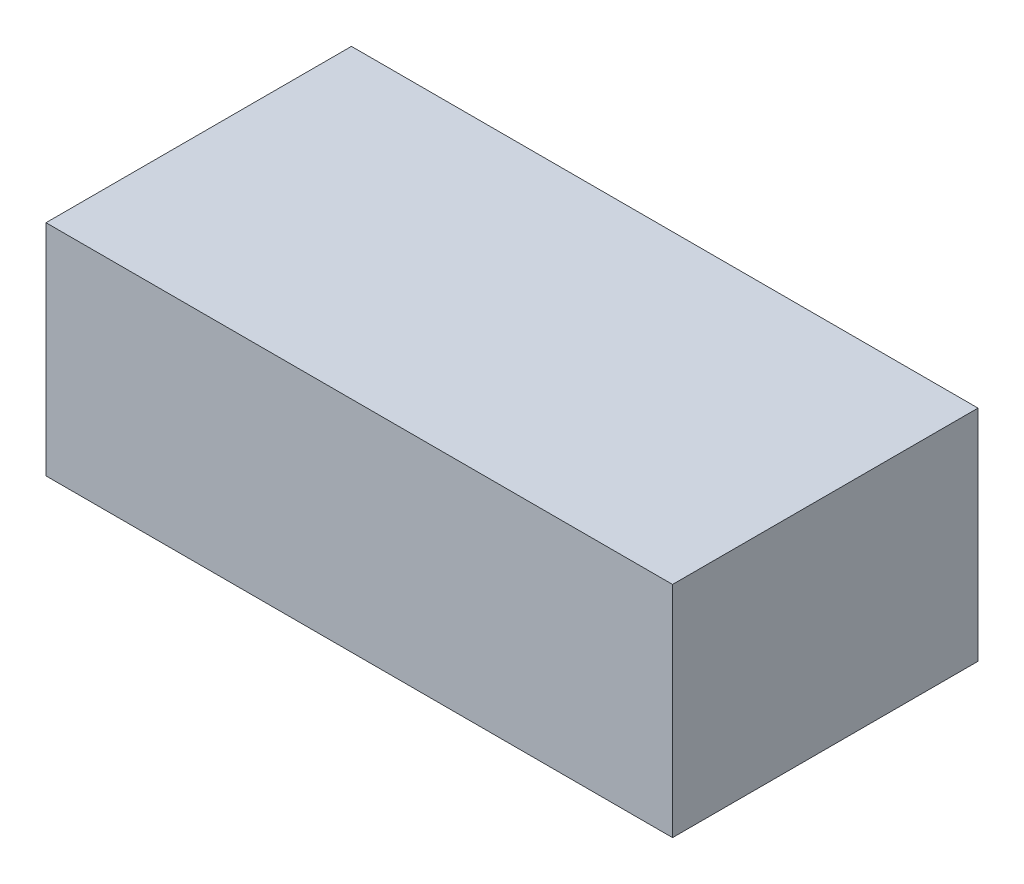
ISO-10303-21;
HEADER;
FILE_DESCRIPTION(('STEP AP214'),'2;1');
FILE_NAME('part.step','',(''),(''),'','','');
FILE_SCHEMA(('AUTOMOTIVE_DESIGN { 1 0 10303 214 1 1 1 1 }'));
ENDSEC;
DATA;
#1=APPLICATION_CONTEXT('core data for automotive mechanical design processes');
#2=APPLICATION_PROTOCOL_DEFINITION('international standard','automotive_design',2000,#1);
#3=PRODUCT_CONTEXT('',#1,'mechanical');
#4=PRODUCT('Part','Part','',(#3));
#5=PRODUCT_RELATED_PRODUCT_CATEGORY('part','',(#4));
#6=PRODUCT_DEFINITION_FORMATION('','',#4);
#7=PRODUCT_DEFINITION_CONTEXT('part definition',#1,'design');
#8=PRODUCT_DEFINITION('design','',#6,#7);
#9=PRODUCT_DEFINITION_SHAPE('','',#8);
#10=(LENGTH_UNIT() NAMED_UNIT(*) SI_UNIT(.MILLI.,.METRE.));
#11=(NAMED_UNIT(*) PLANE_ANGLE_UNIT() SI_UNIT($,.RADIAN.));
#12=(NAMED_UNIT(*) SI_UNIT($,.STERADIAN.) SOLID_ANGLE_UNIT());
#13=UNCERTAINTY_MEASURE_WITH_UNIT(LENGTH_MEASURE(1.E-05),#10,'distance_accuracy_value','');
#14=(GEOMETRIC_REPRESENTATION_CONTEXT(3) GLOBAL_UNCERTAINTY_ASSIGNED_CONTEXT((#13)) GLOBAL_UNIT_ASSIGNED_CONTEXT((#10,
#11,#12)) REPRESENTATION_CONTEXT('',''));
#15=CARTESIAN_POINT('',(0.,0.,0.));
#16=DIRECTION('',(0.,0.,1.));
#17=DIRECTION('',(1.,0.,0.));
#18=AXIS2_PLACEMENT_3D('',#15,#16,#17);
#19=CARTESIAN_POINT('',(0.,28.,0.));
#20=DIRECTION('',(1.,0.,0.));
#21=DIRECTION('',(0.,0.,-1.));
#22=AXIS2_PLACEMENT_3D('',#19,#20,#21);
#23=PLANE('',#22);
#24=DIRECTION('',(0.,0.,1.));
#25=VECTOR('',#24,1.);
#26=CARTESIAN_POINT('',(0.,0.,0.));
#27=LINE('',#26,#25);
#28=CARTESIAN_POINT('',(0.,0.,-39.));
#29=VERTEX_POINT('',#28);
#30=CARTESIAN_POINT('',(0.,0.,0.));
#31=VERTEX_POINT('',#30);
#32=EDGE_CURVE('E101',#29,#31,#27,.T.);
#33=ORIENTED_EDGE('',*,*,#32,.T.);
#34=DIRECTION('',(0.,-1.,0.));
#35=VECTOR('',#34,1.);
#36=CARTESIAN_POINT('',(0.,28.,0.));
#37=LINE('',#36,#35);
#38=CARTESIAN_POINT('',(0.,28.,0.));
#39=VERTEX_POINT('',#38);
#40=EDGE_CURVE('E11',#39,#31,#37,.T.);
#41=ORIENTED_EDGE('',*,*,#40,.F.);
#42=DIRECTION('',(0.,0.,1.));
#43=VECTOR('',#42,1.);
#44=CARTESIAN_POINT('',(0.,28.,0.));
#45=LINE('',#44,#43);
#46=CARTESIAN_POINT('',(0.,28.,-39.));
#47=VERTEX_POINT('',#46);
#48=EDGE_CURVE('E89',#47,#39,#45,.T.);
#49=ORIENTED_EDGE('',*,*,#48,.F.);
#50=DIRECTION('',(0.,-1.,0.));
#51=VECTOR('',#50,1.);
#52=CARTESIAN_POINT('',(0.,28.,-39.));
#53=LINE('',#52,#51);
#54=EDGE_CURVE('E97',#47,#29,#53,.T.);
#55=ORIENTED_EDGE('',*,*,#54,.T.);
#56=EDGE_LOOP('',(#33,#41,#49,#55));
#57=FACE_BOUND('',#56,.T.);
#58=ADVANCED_FACE('F38',(#57),#23,.F.);
#59=CARTESIAN_POINT('',(0.,28.,0.));
#60=DIRECTION('',(0.,0.,-1.));
#61=DIRECTION('',(-1.,0.,0.));
#62=AXIS2_PLACEMENT_3D('',#59,#60,#61);
#63=PLANE('',#62);
#64=DIRECTION('',(1.,0.,0.));
#65=VECTOR('',#64,1.);
#66=CARTESIAN_POINT('',(0.,0.,0.));
#67=LINE('',#66,#65);
#68=CARTESIAN_POINT('',(80.,0.,0.));
#69=VERTEX_POINT('',#68);
#70=EDGE_CURVE('E93',#31,#69,#67,.T.);
#71=ORIENTED_EDGE('',*,*,#70,.T.);
#72=DIRECTION('',(0.,-1.,0.));
#73=VECTOR('',#72,1.);
#74=CARTESIAN_POINT('',(80.,28.,0.));
#75=LINE('',#74,#73);
#76=CARTESIAN_POINT('',(80.,28.,0.));
#77=VERTEX_POINT('',#76);
#78=EDGE_CURVE('E46',#77,#69,#75,.T.);
#79=ORIENTED_EDGE('',*,*,#78,.F.);
#80=DIRECTION('',(1.,0.,0.));
#81=VECTOR('',#80,1.);
#82=CARTESIAN_POINT('',(0.,28.,0.));
#83=LINE('',#82,#81);
#84=EDGE_CURVE('E84',#39,#77,#83,.T.);
#85=ORIENTED_EDGE('',*,*,#84,.F.);
#86=ORIENTED_EDGE('',*,*,#40,.T.);
#87=EDGE_LOOP('',(#71,#79,#85,#86));
#88=FACE_BOUND('',#87,.T.);
#89=ADVANCED_FACE('F92',(#88),#63,.F.);
#90=CARTESIAN_POINT('',(80.,28.,0.));
#91=DIRECTION('',(-1.,0.,0.));
#92=DIRECTION('',(0.,0.,1.));
#93=AXIS2_PLACEMENT_3D('',#90,#91,#92);
#94=PLANE('',#93);
#95=DIRECTION('',(0.,0.,-1.));
#96=VECTOR('',#95,1.);
#97=CARTESIAN_POINT('',(80.,0.,0.));
#98=LINE('',#97,#96);
#99=CARTESIAN_POINT('',(80.,0.,-39.));
#100=VERTEX_POINT('',#99);
#101=EDGE_CURVE('E71',#69,#100,#98,.T.);
#102=ORIENTED_EDGE('',*,*,#101,.T.);
#103=DIRECTION('',(0.,-1.,0.));
#104=VECTOR('',#103,1.);
#105=CARTESIAN_POINT('',(80.,28.,-39.));
#106=LINE('',#105,#104);
#107=CARTESIAN_POINT('',(80.,28.,-39.));
#108=VERTEX_POINT('',#107);
#109=EDGE_CURVE('E94',#108,#100,#106,.T.);
#110=ORIENTED_EDGE('',*,*,#109,.F.);
#111=DIRECTION('',(0.,0.,-1.));
#112=VECTOR('',#111,1.);
#113=CARTESIAN_POINT('',(80.,28.,0.));
#114=LINE('',#113,#112);
#115=EDGE_CURVE('E87',#77,#108,#114,.T.);
#116=ORIENTED_EDGE('',*,*,#115,.F.);
#117=ORIENTED_EDGE('',*,*,#78,.T.);
#118=EDGE_LOOP('',(#102,#110,#116,#117));
#119=FACE_BOUND('',#118,.T.);
#120=ADVANCED_FACE('F95',(#119),#94,.F.);
#121=CARTESIAN_POINT('',(0.,28.,-39.));
#122=DIRECTION('',(0.,0.,1.));
#123=DIRECTION('',(1.,0.,0.));
#124=AXIS2_PLACEMENT_3D('',#121,#122,#123);
#125=PLANE('',#124);
#126=DIRECTION('',(-1.,0.,0.));
#127=VECTOR('',#126,1.);
#128=CARTESIAN_POINT('',(0.,0.,-39.));
#129=LINE('',#128,#127);
#130=EDGE_CURVE('E77',#100,#29,#129,.T.);
#131=ORIENTED_EDGE('',*,*,#130,.T.);
#132=ORIENTED_EDGE('',*,*,#54,.F.);
#133=DIRECTION('',(-1.,0.,0.));
#134=VECTOR('',#133,1.);
#135=CARTESIAN_POINT('',(0.,28.,-39.));
#136=LINE('',#135,#134);
#137=EDGE_CURVE('E54',#108,#47,#136,.T.);
#138=ORIENTED_EDGE('',*,*,#137,.F.);
#139=ORIENTED_EDGE('',*,*,#109,.T.);
#140=EDGE_LOOP('',(#131,#132,#138,#139));
#141=FACE_BOUND('',#140,.T.);
#142=ADVANCED_FACE('F108',(#141),#125,.F.);
#143=CARTESIAN_POINT('',(0.,28.,0.));
#144=DIRECTION('',(0.,-1.,0.));
#145=DIRECTION('',(0.,0.,-1.));
#146=AXIS2_PLACEMENT_3D('',#143,#144,#145);
#147=PLANE('',#146);
#148=ORIENTED_EDGE('',*,*,#48,.T.);
#149=ORIENTED_EDGE('',*,*,#84,.T.);
#150=ORIENTED_EDGE('',*,*,#115,.T.);
#151=ORIENTED_EDGE('',*,*,#137,.T.);
#152=EDGE_LOOP('',(#148,#149,#150,#151));
#153=FACE_BOUND('',#152,.T.);
#154=ADVANCED_FACE('F85',(#153),#147,.F.);
#155=CARTESIAN_POINT('',(0.,0.,0.));
#156=DIRECTION('',(0.,-1.,0.));
#157=DIRECTION('',(0.,0.,-1.));
#158=AXIS2_PLACEMENT_3D('',#155,#156,#157);
#159=PLANE('',#158);
#160=ORIENTED_EDGE('',*,*,#32,.F.);
#161=ORIENTED_EDGE('',*,*,#130,.F.);
#162=ORIENTED_EDGE('',*,*,#101,.F.);
#163=ORIENTED_EDGE('',*,*,#70,.F.);
#164=EDGE_LOOP('',(#160,#161,#162,#163));
#165=FACE_BOUND('',#164,.T.);
#166=ADVANCED_FACE('F111',(#165),#159,.T.);
#167=CLOSED_SHELL('',(#58,#89,#120,#142,#154,#166));
#168=MANIFOLD_SOLID_BREP('B2',#167);
#169=ADVANCED_BREP_SHAPE_REPRESENTATION('',(#18,#168),#14);
#170=SHAPE_DEFINITION_REPRESENTATION(#9,#169);
ENDSEC;
END-ISO-10303-21;
